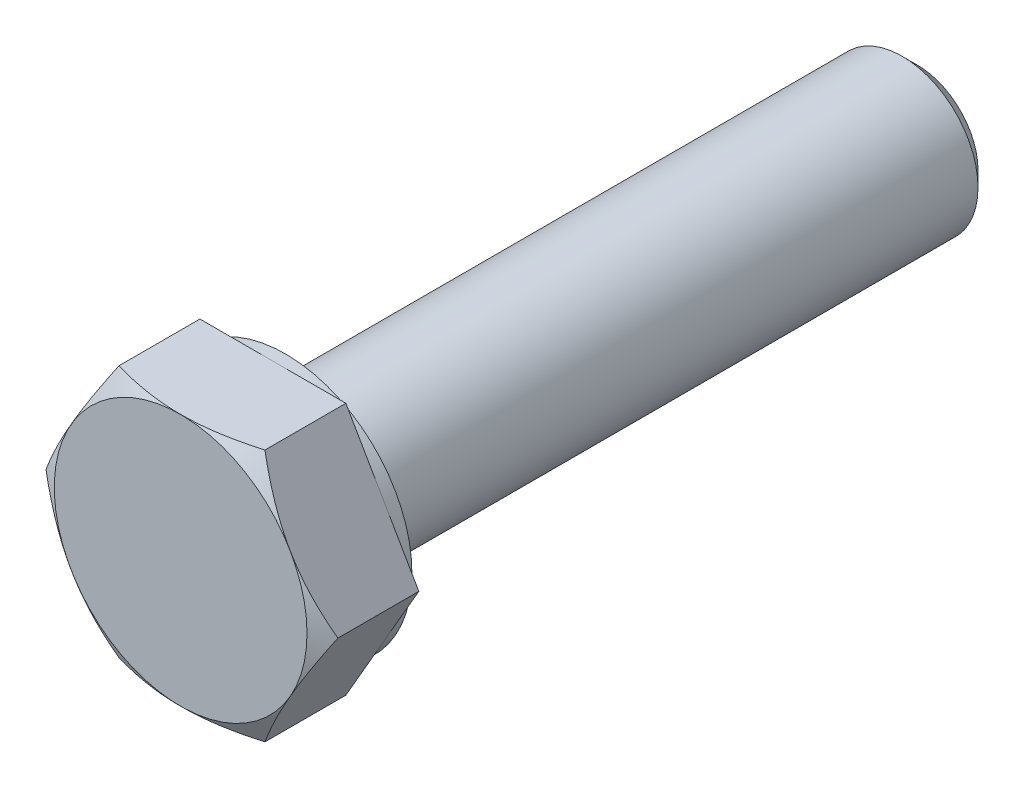
ISO-10303-21;
HEADER;
FILE_DESCRIPTION(('STEP AP214'),'2;1');
FILE_NAME('part.step','',(''),(''),'','','');
FILE_SCHEMA(('AUTOMOTIVE_DESIGN { 1 0 10303 214 1 1 1 1 }'));
ENDSEC;
DATA;
#1=APPLICATION_CONTEXT('core data for automotive mechanical design processes');
#2=APPLICATION_PROTOCOL_DEFINITION('international standard','automotive_design',2000,#1);
#3=PRODUCT_CONTEXT('',#1,'mechanical');
#4=PRODUCT('Part','Part','',(#3));
#5=PRODUCT_RELATED_PRODUCT_CATEGORY('part','',(#4));
#6=PRODUCT_DEFINITION_FORMATION('','',#4);
#7=PRODUCT_DEFINITION_CONTEXT('part definition',#1,'design');
#8=PRODUCT_DEFINITION('design','',#6,#7);
#9=PRODUCT_DEFINITION_SHAPE('','',#8);
#10=(LENGTH_UNIT() NAMED_UNIT(*) SI_UNIT(.MILLI.,.METRE.));
#11=(NAMED_UNIT(*) PLANE_ANGLE_UNIT() SI_UNIT($,.RADIAN.));
#12=(NAMED_UNIT(*) SI_UNIT($,.STERADIAN.) SOLID_ANGLE_UNIT());
#13=UNCERTAINTY_MEASURE_WITH_UNIT(LENGTH_MEASURE(1.E-05),#10,'distance_accuracy_value','');
#14=(GEOMETRIC_REPRESENTATION_CONTEXT(3) GLOBAL_UNCERTAINTY_ASSIGNED_CONTEXT((#13)) GLOBAL_UNIT_ASSIGNED_CONTEXT((#10,
#11,#12)) REPRESENTATION_CONTEXT('',''));
#15=CARTESIAN_POINT('',(0.,0.,0.));
#16=DIRECTION('',(0.,0.,1.));
#17=DIRECTION('',(1.,0.,0.));
#18=AXIS2_PLACEMENT_3D('',#15,#16,#17);
#19=CARTESIAN_POINT('',(0.,0.,4.15));
#20=DIRECTION('',(0.,0.,1.));
#21=DIRECTION('',(1.,0.,0.));
#22=AXIS2_PLACEMENT_3D('',#19,#20,#21);
#23=PLANE('',#22);
#24=CARTESIAN_POINT('',(0.,0.,4.15));
#25=DIRECTION('',(0.,0.,1.));
#26=DIRECTION('',(1.,0.,0.));
#27=AXIS2_PLACEMENT_3D('',#24,#25,#26);
#28=CIRCLE('',#27,5.);
#29=CARTESIAN_POINT('',(5.,0.,4.15));
#30=VERTEX_POINT('',#29);
#31=EDGE_CURVE('E10',#30,#30,#28,.T.);
#32=ORIENTED_EDGE('',*,*,#31,.T.);
#33=EDGE_LOOP('',(#32));
#34=FACE_BOUND('',#33,.T.);
#35=ADVANCED_FACE('F16',(#34),#23,.T.);
#36=CARTESIAN_POINT('',(0.,0.,4.15));
#37=DIRECTION('',(0.,0.,-1.));
#38=DIRECTION('',(1.,0.,0.));
#39=AXIS2_PLACEMENT_3D('',#36,#37,#38);
#40=CONICAL_SURFACE('',#39,5.,1.047197551197);
#41=CARTESIAN_POINT('',(2.8874999999992,5.00129670685568,3.70255354137743));
#42=CARTESIAN_POINT('',(4.33124999999986,2.50064835342825,4.53610299252072));
#43=CARTESIAN_POINT('',(5.77500000000043,9.62341317745086E-13,3.70255354137764));
#44=(BOUNDED_CURVE() B_SPLINE_CURVE(2,(#41,#42,#43),.UNSPECIFIED.,.F.,
.F.) B_SPLINE_CURVE_WITH_KNOTS((3,3),(0.,1.),
.UNSPECIFIED.) CURVE() GEOMETRIC_REPRESENTATION_ITEM() RATIONAL_B_SPLINE_CURVE((1.,
1.15470053837938,1.)) REPRESENTATION_ITEM(''));
#45=CARTESIAN_POINT('',(2.8875,5.001296706855,3.702553541378));
#46=VERTEX_POINT('',#45);
#47=CARTESIAN_POINT('',(5.775,0.,3.702553541378));
#48=VERTEX_POINT('',#47);
#49=EDGE_CURVE('E152',#46,#48,#44,.T.);
#50=ORIENTED_EDGE('',*,*,#49,.F.);
#51=CARTESIAN_POINT('',(-2.88750000000039,5.001296706855,3.70255354137778));
#52=CARTESIAN_POINT('',(-1.94066984704477E-13,5.00129670685504,4.53610299252048));
#53=CARTESIAN_POINT('',(2.88749999999987,5.001296706855,3.70255354137793));
#54=(BOUNDED_CURVE() B_SPLINE_CURVE(2,(#51,#52,#53),.UNSPECIFIED.,.F.,
.F.) B_SPLINE_CURVE_WITH_KNOTS((3,3),(0.,1.),
.UNSPECIFIED.) CURVE() GEOMETRIC_REPRESENTATION_ITEM() RATIONAL_B_SPLINE_CURVE((1.,
1.15470053837927,1.)) REPRESENTATION_ITEM(''));
#55=CARTESIAN_POINT('',(-2.8875,5.001296706855,3.702553541378));
#56=VERTEX_POINT('',#55);
#57=EDGE_CURVE('E168',#56,#46,#54,.T.);
#58=ORIENTED_EDGE('',*,*,#57,.F.);
#59=CARTESIAN_POINT('',(-5.7750000000016,-1.0627054791712E-12,3.70255354137697));
#60=CARTESIAN_POINT('',(-4.33125000000055,2.50064835342705,4.53610299252083));
#61=CARTESIAN_POINT('',(-2.88749999999986,5.00129670685454,3.70255354137781));
#62=(BOUNDED_CURVE() B_SPLINE_CURVE(2,(#59,#60,#61),.UNSPECIFIED.,.F.,
.F.) B_SPLINE_CURVE_WITH_KNOTS((3,3),(0.,1.),
.UNSPECIFIED.) CURVE() GEOMETRIC_REPRESENTATION_ITEM() RATIONAL_B_SPLINE_CURVE((1.,
1.15470053837943,1.)) REPRESENTATION_ITEM(''));
#63=CARTESIAN_POINT('',(-5.775,0.,3.702553541378));
#64=VERTEX_POINT('',#63);
#65=EDGE_CURVE('E174',#64,#56,#62,.T.);
#66=ORIENTED_EDGE('',*,*,#65,.F.);
#67=CARTESIAN_POINT('',(-2.8874999999992,-5.00129670685568,3.70255354137743));
#68=CARTESIAN_POINT('',(-4.33124999999987,-2.50064835342823,4.53610299252073));
#69=CARTESIAN_POINT('',(-5.77500000000045,-9.2104102122903E-13,3.70255354137763));
#70=(BOUNDED_CURVE() B_SPLINE_CURVE(2,(#67,#68,#69),.UNSPECIFIED.,.F.,
.F.) B_SPLINE_CURVE_WITH_KNOTS((3,3),(0.,1.),
.UNSPECIFIED.) CURVE() GEOMETRIC_REPRESENTATION_ITEM() RATIONAL_B_SPLINE_CURVE((1.,
1.15470053837938,1.)) REPRESENTATION_ITEM(''));
#71=CARTESIAN_POINT('',(-2.8875,-5.001296706855,3.702553541378));
#72=VERTEX_POINT('',#71);
#73=EDGE_CURVE('E189',#72,#64,#70,.T.);
#74=ORIENTED_EDGE('',*,*,#73,.F.);
#75=CARTESIAN_POINT('',(2.88750000000039,-5.001296706855,3.70255354137778));
#76=CARTESIAN_POINT('',(1.93622895494628E-13,-5.00129670685504,4.53610299252048));
#77=CARTESIAN_POINT('',(-2.88749999999987,-5.001296706855,3.70255354137793));
#78=(BOUNDED_CURVE() B_SPLINE_CURVE(2,(#75,#76,#77),.UNSPECIFIED.,.F.,
.F.) B_SPLINE_CURVE_WITH_KNOTS((3,3),(0.,1.),
.UNSPECIFIED.) CURVE() GEOMETRIC_REPRESENTATION_ITEM() RATIONAL_B_SPLINE_CURVE((1.,
1.15470053837927,1.)) REPRESENTATION_ITEM(''));
#79=CARTESIAN_POINT('',(2.8875,-5.001296706855,3.702553541378));
#80=VERTEX_POINT('',#79);
#81=EDGE_CURVE('E200',#80,#72,#78,.T.);
#82=ORIENTED_EDGE('',*,*,#81,.F.);
#83=CARTESIAN_POINT('',(5.77500000000167,1.18571819029967E-12,3.70255354137693));
#84=CARTESIAN_POINT('',(4.33125000000057,-2.50064835342701,4.53610299252084));
#85=CARTESIAN_POINT('',(2.88749999999986,-5.00129670685454,3.70255354137781));
#86=(BOUNDED_CURVE() B_SPLINE_CURVE(2,(#83,#84,#85),.UNSPECIFIED.,.F.,
.F.) B_SPLINE_CURVE_WITH_KNOTS((3,3),(0.,1.),
.UNSPECIFIED.) CURVE() GEOMETRIC_REPRESENTATION_ITEM() RATIONAL_B_SPLINE_CURVE((1.,
1.15470053837944,1.)) REPRESENTATION_ITEM(''));
#87=EDGE_CURVE('E20',#48,#80,#86,.T.);
#88=ORIENTED_EDGE('',*,*,#87,.F.);
#89=DIRECTION('',(0.866025403784329,0.,-0.50000000000019));
#90=VECTOR('',#89,1.);
#91=CARTESIAN_POINT('',(5.,0.,4.15));
#92=LINE('',#91,#90);
#93=EDGE_CURVE('E28',#30,#48,#92,.T.);
#94=ORIENTED_EDGE('',*,*,#93,.F.);
#95=ORIENTED_EDGE('',*,*,#31,.F.);
#96=ORIENTED_EDGE('',*,*,#93,.T.);
#97=EDGE_LOOP('',(#50,#58,#66,#74,#82,#88,#94,#95,#96));
#98=FACE_BOUND('',#97,.T.);
#99=ADVANCED_FACE('F18',(#98),#40,.T.);
#100=CARTESIAN_POINT('',(2.8875,-5.001296706855,0.));
#101=DIRECTION('',(-0.866025403784329,0.50000000000019,0.));
#102=DIRECTION('',(0.,0.,1.));
#103=AXIS2_PLACEMENT_3D('',#100,#101,#102);
#104=PLANE('',#103);
#105=DIRECTION('',(0.,0.,1.));
#106=VECTOR('',#105,1.);
#107=CARTESIAN_POINT('',(5.775,0.,0.5));
#108=LINE('',#107,#106);
#109=CARTESIAN_POINT('',(5.775,0.,0.5));
#110=VERTEX_POINT('',#109);
#111=EDGE_CURVE('E158',#110,#48,#108,.T.);
#112=ORIENTED_EDGE('',*,*,#111,.T.);
#113=ORIENTED_EDGE('',*,*,#87,.T.);
#114=DIRECTION('',(0.,0.,1.));
#115=VECTOR('',#114,1.);
#116=CARTESIAN_POINT('',(2.8875,-5.001296706855,0.));
#117=LINE('',#116,#115);
#118=CARTESIAN_POINT('',(2.8875,-5.001296706855,0.5));
#119=VERTEX_POINT('',#118);
#120=EDGE_CURVE('E194',#119,#80,#117,.T.);
#121=ORIENTED_EDGE('',*,*,#120,.F.);
#122=DIRECTION('',(0.50000000000019,0.866025403784329,0.));
#123=VECTOR('',#122,1.);
#124=CARTESIAN_POINT('',(3.609375,-3.750972530141,0.5));
#125=LINE('',#124,#123);
#126=EDGE_CURVE('E126',#119,#110,#125,.T.);
#127=ORIENTED_EDGE('',*,*,#126,.T.);
#128=EDGE_LOOP('',(#112,#113,#121,#127));
#129=FACE_BOUND('',#128,.T.);
#130=ADVANCED_FACE('F309',(#129),#104,.F.);
#131=CARTESIAN_POINT('',(-2.8875,-5.001296706855,0.));
#132=DIRECTION('',(0.,1.,0.));
#133=DIRECTION('',(1.,0.,0.));
#134=AXIS2_PLACEMENT_3D('',#131,#132,#133);
#135=PLANE('',#134);
#136=ORIENTED_EDGE('',*,*,#120,.T.);
#137=ORIENTED_EDGE('',*,*,#81,.T.);
#138=DIRECTION('',(0.,0.,1.));
#139=VECTOR('',#138,1.);
#140=CARTESIAN_POINT('',(-2.8875,-5.001296706855,0.));
#141=LINE('',#140,#139);
#142=CARTESIAN_POINT('',(-2.8875,-5.001296706855,0.5));
#143=VERTEX_POINT('',#142);
#144=EDGE_CURVE('E182',#143,#72,#141,.T.);
#145=ORIENTED_EDGE('',*,*,#144,.F.);
#146=DIRECTION('',(1.,0.,0.));
#147=VECTOR('',#146,1.);
#148=CARTESIAN_POINT('',(-1.44375,-5.001296706855,0.5));
#149=LINE('',#148,#147);
#150=EDGE_CURVE('E135',#143,#119,#149,.T.);
#151=ORIENTED_EDGE('',*,*,#150,.T.);
#152=EDGE_LOOP('',(#136,#137,#145,#151));
#153=FACE_BOUND('',#152,.T.);
#154=ADVANCED_FACE('F314',(#153),#135,.F.);
#155=CARTESIAN_POINT('',(-5.775,0.,0.));
#156=DIRECTION('',(0.866025403784329,0.50000000000019,0.));
#157=DIRECTION('',(0.,0.,-1.));
#158=AXIS2_PLACEMENT_3D('',#155,#156,#157);
#159=PLANE('',#158);
#160=ORIENTED_EDGE('',*,*,#144,.T.);
#161=ORIENTED_EDGE('',*,*,#73,.T.);
#162=DIRECTION('',(0.,0.,1.));
#163=VECTOR('',#162,1.);
#164=CARTESIAN_POINT('',(-5.775,0.,0.));
#165=LINE('',#164,#163);
#166=CARTESIAN_POINT('',(-5.775,0.,0.5));
#167=VERTEX_POINT('',#166);
#168=EDGE_CURVE('E173',#167,#64,#165,.T.);
#169=ORIENTED_EDGE('',*,*,#168,.F.);
#170=DIRECTION('',(0.50000000000019,-0.866025403784329,0.));
#171=VECTOR('',#170,1.);
#172=CARTESIAN_POINT('',(-5.053125,-1.250324176714,0.5));
#173=LINE('',#172,#171);
#174=EDGE_CURVE('E137',#167,#143,#173,.T.);
#175=ORIENTED_EDGE('',*,*,#174,.T.);
#176=EDGE_LOOP('',(#160,#161,#169,#175));
#177=FACE_BOUND('',#176,.T.);
#178=ADVANCED_FACE('F258',(#177),#159,.F.);
#179=CARTESIAN_POINT('',(-2.8875,5.001296706855,0.));
#180=DIRECTION('',(0.866025403784329,-0.50000000000019,0.));
#181=DIRECTION('',(0.,0.,-1.));
#182=AXIS2_PLACEMENT_3D('',#179,#180,#181);
#183=PLANE('',#182);
#184=ORIENTED_EDGE('',*,*,#168,.T.);
#185=ORIENTED_EDGE('',*,*,#65,.T.);
#186=DIRECTION('',(0.,0.,1.));
#187=VECTOR('',#186,1.);
#188=CARTESIAN_POINT('',(-2.8875,5.001296706855,0.));
#189=LINE('',#188,#187);
#190=CARTESIAN_POINT('',(-2.8875,5.001296706855,0.5));
#191=VERTEX_POINT('',#190);
#192=EDGE_CURVE('E164',#191,#56,#189,.T.);
#193=ORIENTED_EDGE('',*,*,#192,.F.);
#194=DIRECTION('',(-0.50000000000019,-0.866025403784329,0.));
#195=VECTOR('',#194,1.);
#196=CARTESIAN_POINT('',(-3.609375,3.750972530141,0.5));
#197=LINE('',#196,#195);
#198=EDGE_CURVE('E147',#191,#167,#197,.T.);
#199=ORIENTED_EDGE('',*,*,#198,.T.);
#200=EDGE_LOOP('',(#184,#185,#193,#199));
#201=FACE_BOUND('',#200,.T.);
#202=ADVANCED_FACE('F252',(#201),#183,.F.);
#203=CARTESIAN_POINT('',(2.8875,5.001296706855,0.));
#204=DIRECTION('',(0.,-1.,0.));
#205=DIRECTION('',(-1.,0.,0.));
#206=AXIS2_PLACEMENT_3D('',#203,#204,#205);
#207=PLANE('',#206);
#208=ORIENTED_EDGE('',*,*,#192,.T.);
#209=ORIENTED_EDGE('',*,*,#57,.T.);
#210=DIRECTION('',(0.,0.,1.));
#211=VECTOR('',#210,1.);
#212=CARTESIAN_POINT('',(2.8875,5.001296706855,0.));
#213=LINE('',#212,#211);
#214=CARTESIAN_POINT('',(2.8875,5.001296706855,0.5));
#215=VERTEX_POINT('',#214);
#216=EDGE_CURVE('E148',#215,#46,#213,.T.);
#217=ORIENTED_EDGE('',*,*,#216,.F.);
#218=DIRECTION('',(-1.,0.,0.));
#219=VECTOR('',#218,1.);
#220=CARTESIAN_POINT('',(1.44375,5.001296706855,0.5));
#221=LINE('',#220,#219);
#222=EDGE_CURVE('E133',#215,#191,#221,.T.);
#223=ORIENTED_EDGE('',*,*,#222,.T.);
#224=EDGE_LOOP('',(#208,#209,#217,#223));
#225=FACE_BOUND('',#224,.T.);
#226=ADVANCED_FACE('F257',(#225),#207,.F.);
#227=CARTESIAN_POINT('',(5.775,0.,0.));
#228=DIRECTION('',(-0.866025403784329,-0.50000000000019,0.));
#229=DIRECTION('',(-0.50000000000019,0.866025403784329,0.));
#230=AXIS2_PLACEMENT_3D('',#227,#228,#229);
#231=PLANE('',#230);
#232=ORIENTED_EDGE('',*,*,#216,.T.);
#233=ORIENTED_EDGE('',*,*,#49,.T.);
#234=ORIENTED_EDGE('',*,*,#111,.F.);
#235=DIRECTION('',(-0.50000000000019,0.866025403784329,0.));
#236=VECTOR('',#235,1.);
#237=CARTESIAN_POINT('',(5.053125,1.250324176714,0.5));
#238=LINE('',#237,#236);
#239=EDGE_CURVE('E118',#110,#215,#238,.T.);
#240=ORIENTED_EDGE('',*,*,#239,.T.);
#241=EDGE_LOOP('',(#232,#233,#234,#240));
#242=FACE_BOUND('',#241,.T.);
#243=ADVANCED_FACE('F289',(#242),#231,.F.);
#244=CARTESIAN_POINT('',(0.,0.,0.5));
#245=DIRECTION('',(0.,0.,1.));
#246=DIRECTION('',(1.,0.,0.));
#247=AXIS2_PLACEMENT_3D('',#244,#245,#246);
#248=PLANE('',#247);
#249=CARTESIAN_POINT('',(0.,0.,0.5));
#250=DIRECTION('',(0.,0.,1.));
#251=DIRECTION('',(1.,0.,0.));
#252=AXIS2_PLACEMENT_3D('',#249,#250,#251);
#253=CIRCLE('',#252,5.);
#254=CARTESIAN_POINT('',(5.,0.,0.5));
#255=VERTEX_POINT('',#254);
#256=EDGE_CURVE('E112',#255,#255,#253,.T.);
#257=ORIENTED_EDGE('',*,*,#256,.T.);
#258=EDGE_LOOP('',(#257));
#259=FACE_BOUND('',#258,.T.);
#260=ORIENTED_EDGE('',*,*,#239,.F.);
#261=ORIENTED_EDGE('',*,*,#126,.F.);
#262=ORIENTED_EDGE('',*,*,#150,.F.);
#263=ORIENTED_EDGE('',*,*,#174,.F.);
#264=ORIENTED_EDGE('',*,*,#198,.F.);
#265=ORIENTED_EDGE('',*,*,#222,.F.);
#266=EDGE_LOOP('',(#260,#261,#262,#263,#264,#265));
#267=FACE_BOUND('',#266,.T.);
#268=ADVANCED_FACE('F113',(#259,#267),#248,.F.);
#269=CARTESIAN_POINT('',(0.,0.,0.));
#270=DIRECTION('',(0.,0.,1.));
#271=DIRECTION('',(1.,0.,0.));
#272=AXIS2_PLACEMENT_3D('',#269,#270,#271);
#273=CYLINDRICAL_SURFACE('',#272,5.);
#274=CARTESIAN_POINT('',(0.,0.,0.));
#275=DIRECTION('',(0.,0.,1.));
#276=DIRECTION('',(1.,0.,0.));
#277=AXIS2_PLACEMENT_3D('',#274,#275,#276);
#278=CIRCLE('',#277,5.);
#279=CARTESIAN_POINT('',(5.,0.,0.));
#280=VERTEX_POINT('',#279);
#281=EDGE_CURVE('E129',#280,#280,#278,.T.);
#282=ORIENTED_EDGE('',*,*,#281,.T.);
#283=DIRECTION('',(0.,0.,1.));
#284=VECTOR('',#283,1.);
#285=CARTESIAN_POINT('',(5.,0.,0.));
#286=LINE('',#285,#284);
#287=EDGE_CURVE('E119',#280,#255,#286,.T.);
#288=ORIENTED_EDGE('',*,*,#287,.T.);
#289=ORIENTED_EDGE('',*,*,#256,.F.);
#290=ORIENTED_EDGE('',*,*,#287,.F.);
#291=EDGE_LOOP('',(#282,#288,#289,#290));
#292=FACE_BOUND('',#291,.T.);
#293=ADVANCED_FACE('F281',(#292),#273,.T.);
#294=CARTESIAN_POINT('',(0.,0.,0.));
#295=DIRECTION('',(0.,0.,1.));
#296=DIRECTION('',(1.,0.,0.));
#297=AXIS2_PLACEMENT_3D('',#294,#295,#296);
#298=PLANE('',#297);
#299=ORIENTED_EDGE('',*,*,#281,.F.);
#300=EDGE_LOOP('',(#299));
#301=FACE_BOUND('',#300,.T.);
#302=CARTESIAN_POINT('',(0.,0.,0.));
#303=DIRECTION('',(0.,0.,1.));
#304=DIRECTION('',(1.,0.,0.));
#305=AXIS2_PLACEMENT_3D('',#302,#303,#304);
#306=CIRCLE('',#305,3.);
#307=CARTESIAN_POINT('',(3.,0.,0.));
#308=VERTEX_POINT('',#307);
#309=EDGE_CURVE('E412',#308,#308,#306,.T.);
#310=ORIENTED_EDGE('',*,*,#309,.T.);
#311=EDGE_LOOP('',(#310));
#312=FACE_BOUND('',#311,.T.);
#313=ADVANCED_FACE('F270',(#301,#312),#298,.F.);
#314=CARTESIAN_POINT('',(0.,0.,-24.4));
#315=DIRECTION('',(0.,0.,1.));
#316=DIRECTION('',(1.,0.,0.));
#317=AXIS2_PLACEMENT_3D('',#314,#315,#316);
#318=CYLINDRICAL_SURFACE('',#317,3.);
#319=CARTESIAN_POINT('',(0.,0.,-24.4));
#320=DIRECTION('',(0.,0.,1.));
#321=DIRECTION('',(1.,0.,0.));
#322=AXIS2_PLACEMENT_3D('',#319,#320,#321);
#323=CIRCLE('',#322,3.);
#324=CARTESIAN_POINT('',(3.,0.,-24.4));
#325=VERTEX_POINT('',#324);
#326=EDGE_CURVE('E403',#325,#325,#323,.T.);
#327=ORIENTED_EDGE('',*,*,#326,.T.);
#328=DIRECTION('',(0.,0.,1.));
#329=VECTOR('',#328,1.);
#330=CARTESIAN_POINT('',(3.,0.,-24.4));
#331=LINE('',#330,#329);
#332=EDGE_CURVE('E408',#325,#308,#331,.T.);
#333=ORIENTED_EDGE('',*,*,#332,.T.);
#334=ORIENTED_EDGE('',*,*,#309,.F.);
#335=ORIENTED_EDGE('',*,*,#332,.F.);
#336=EDGE_LOOP('',(#327,#333,#334,#335));
#337=FACE_BOUND('',#336,.T.);
#338=ADVANCED_FACE('F234',(#337),#318,.T.);
#339=CARTESIAN_POINT('',(0.,0.,-25.));
#340=DIRECTION('',(0.,0.,1.));
#341=DIRECTION('',(1.,0.,0.));
#342=AXIS2_PLACEMENT_3D('',#339,#340,#341);
#343=CONICAL_SURFACE('',#342,2.4,0.785398163397);
#344=CARTESIAN_POINT('',(0.,0.,-25.));
#345=DIRECTION('',(0.,0.,1.));
#346=DIRECTION('',(1.,0.,0.));
#347=AXIS2_PLACEMENT_3D('',#344,#345,#346);
#348=CIRCLE('',#347,2.4);
#349=CARTESIAN_POINT('',(2.4,0.,-25.));
#350=VERTEX_POINT('',#349);
#351=EDGE_CURVE('E400',#350,#350,#348,.T.);
#352=ORIENTED_EDGE('',*,*,#351,.T.);
#353=DIRECTION('',(0.707106781186548,0.,0.707106781186548));
#354=VECTOR('',#353,1.);
#355=CARTESIAN_POINT('',(2.4,0.,-25.));
#356=LINE('',#355,#354);
#357=EDGE_CURVE('E401',#350,#325,#356,.T.);
#358=ORIENTED_EDGE('',*,*,#357,.T.);
#359=ORIENTED_EDGE('',*,*,#326,.F.);
#360=ORIENTED_EDGE('',*,*,#357,.F.);
#361=EDGE_LOOP('',(#352,#358,#359,#360));
#362=FACE_BOUND('',#361,.T.);
#363=ADVANCED_FACE('F221',(#362),#343,.T.);
#364=CARTESIAN_POINT('',(0.,0.,-25.));
#365=DIRECTION('',(0.,0.,1.));
#366=DIRECTION('',(1.,0.,0.));
#367=AXIS2_PLACEMENT_3D('',#364,#365,#366);
#368=PLANE('',#367);
#369=ORIENTED_EDGE('',*,*,#351,.F.);
#370=EDGE_LOOP('',(#369));
#371=FACE_BOUND('',#370,.T.);
#372=ADVANCED_FACE('F215',(#371),#368,.F.);
#373=CLOSED_SHELL('',(#35,#99,#130,#154,#178,#202,#226,#243,#268,#293,#313,#338,#363,#372));
#374=MANIFOLD_SOLID_BREP('B1',#373);
#375=ADVANCED_BREP_SHAPE_REPRESENTATION('',(#18,#374),#14);
#376=SHAPE_DEFINITION_REPRESENTATION(#9,#375);
ENDSEC;
END-ISO-10303-21;
